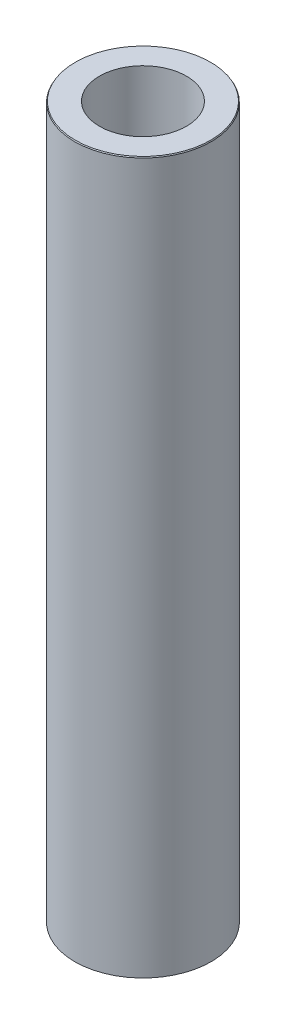
ISO-10303-21;
HEADER;
FILE_DESCRIPTION(('STEP AP214'),'2;1');
FILE_NAME('part.step','',(''),(''),'','','');
FILE_SCHEMA(('AUTOMOTIVE_DESIGN { 1 0 10303 214 1 1 1 1 }'));
ENDSEC;
DATA;
#1=APPLICATION_CONTEXT('core data for automotive mechanical design processes');
#2=APPLICATION_PROTOCOL_DEFINITION('international standard','automotive_design',2000,#1);
#3=PRODUCT_CONTEXT('',#1,'mechanical');
#4=PRODUCT('Part','Part','',(#3));
#5=PRODUCT_RELATED_PRODUCT_CATEGORY('part','',(#4));
#6=PRODUCT_DEFINITION_FORMATION('','',#4);
#7=PRODUCT_DEFINITION_CONTEXT('part definition',#1,'design');
#8=PRODUCT_DEFINITION('design','',#6,#7);
#9=PRODUCT_DEFINITION_SHAPE('','',#8);
#10=(LENGTH_UNIT() NAMED_UNIT(*) SI_UNIT(.MILLI.,.METRE.));
#11=(NAMED_UNIT(*) PLANE_ANGLE_UNIT() SI_UNIT($,.RADIAN.));
#12=(NAMED_UNIT(*) SI_UNIT($,.STERADIAN.) SOLID_ANGLE_UNIT());
#13=UNCERTAINTY_MEASURE_WITH_UNIT(LENGTH_MEASURE(1.E-05),#10,'distance_accuracy_value','');
#14=(GEOMETRIC_REPRESENTATION_CONTEXT(3) GLOBAL_UNCERTAINTY_ASSIGNED_CONTEXT((#13)) GLOBAL_UNIT_ASSIGNED_CONTEXT((#10,
#11,#12)) REPRESENTATION_CONTEXT('',''));
#15=CARTESIAN_POINT('',(0.,0.,0.));
#16=DIRECTION('',(0.,0.,1.));
#17=DIRECTION('',(1.,0.,0.));
#18=AXIS2_PLACEMENT_3D('',#15,#16,#17);
#19=CARTESIAN_POINT('',(0.,600.,0.));
#20=DIRECTION('',(0.,-1.,0.));
#21=DIRECTION('',(0.,0.,-1.));
#22=AXIS2_PLACEMENT_3D('',#19,#20,#21);
#23=CYLINDRICAL_SURFACE('',#22,57.5);
#24=CARTESIAN_POINT('',(0.,599.141360255556,0.));
#25=DIRECTION('',(0.,1.,0.));
#26=DIRECTION('',(0.,0.,1.));
#27=AXIS2_PLACEMENT_3D('',#24,#25,#26);
#28=CIRCLE('',#27,57.5);
#29=CARTESIAN_POINT('',(0.,599.141360255556,57.5));
#30=VERTEX_POINT('',#29);
#31=EDGE_CURVE('E50',#30,#30,#28,.F.);
#32=ORIENTED_EDGE('',*,*,#31,.T.);
#33=EDGE_LOOP('',(#32));
#34=FACE_BOUND('',#33,.T.);
#35=CARTESIAN_POINT('',(0.,0.495735887591664,0.));
#36=DIRECTION('',(0.,1.,0.));
#37=DIRECTION('',(0.,0.,1.));
#38=AXIS2_PLACEMENT_3D('',#35,#36,#37);
#39=CIRCLE('',#38,57.5);
#40=CARTESIAN_POINT('',(0.,0.495735887591664,57.5));
#41=VERTEX_POINT('',#40);
#42=EDGE_CURVE('E51',#41,#41,#39,.T.);
#43=ORIENTED_EDGE('',*,*,#42,.T.);
#44=EDGE_LOOP('',(#43));
#45=FACE_BOUND('',#44,.T.);
#46=ADVANCED_FACE('F39',(#34,#45),#23,.T.);
#47=CARTESIAN_POINT('',(0.,600.,0.));
#48=DIRECTION('',(0.,1.,0.));
#49=DIRECTION('',(0.,0.,1.));
#50=AXIS2_PLACEMENT_3D('',#47,#48,#49);
#51=PLANE('',#50);
#52=CARTESIAN_POINT('',(0.,600.,0.));
#53=DIRECTION('',(0.,1.,0.));
#54=DIRECTION('',(0.,0.,1.));
#55=AXIS2_PLACEMENT_3D('',#52,#53,#54);
#56=CIRCLE('',#55,57.0042641124083);
#57=CARTESIAN_POINT('',(0.,600.,57.0042641124083));
#58=VERTEX_POINT('',#57);
#59=EDGE_CURVE('E54',#58,#58,#56,.T.);
#60=ORIENTED_EDGE('',*,*,#59,.T.);
#61=EDGE_LOOP('',(#60));
#62=FACE_BOUND('',#61,.T.);
#63=CARTESIAN_POINT('',(0.,600.,0.));
#64=DIRECTION('',(0.,1.,0.));
#65=DIRECTION('',(0.,0.,1.));
#66=AXIS2_PLACEMENT_3D('',#63,#64,#65);
#67=CIRCLE('',#66,36.6710345801944);
#68=CARTESIAN_POINT('',(0.,600.,36.6710345801944));
#69=VERTEX_POINT('',#68);
#70=EDGE_CURVE('E58',#69,#69,#67,.T.);
#71=ORIENTED_EDGE('',*,*,#70,.F.);
#72=EDGE_LOOP('',(#71));
#73=FACE_BOUND('',#72,.T.);
#74=ADVANCED_FACE('F69',(#62,#73),#51,.T.);
#75=CARTESIAN_POINT('',(0.,0.,0.));
#76=DIRECTION('',(0.,1.,0.));
#77=DIRECTION('',(0.,0.,1.));
#78=AXIS2_PLACEMENT_3D('',#75,#76,#77);
#79=PLANE('',#78);
#80=CARTESIAN_POINT('',(0.,0.,0.));
#81=DIRECTION('',(0.,1.,0.));
#82=DIRECTION('',(0.,0.,1.));
#83=AXIS2_PLACEMENT_3D('',#80,#81,#82);
#84=CIRCLE('',#83,56.6413602555559);
#85=CARTESIAN_POINT('',(0.,0.,56.6413602555559));
#86=VERTEX_POINT('',#85);
#87=EDGE_CURVE('E10',#86,#86,#84,.F.);
#88=ORIENTED_EDGE('',*,*,#87,.T.);
#89=EDGE_LOOP('',(#88));
#90=FACE_BOUND('',#89,.T.);
#91=CARTESIAN_POINT('',(0.,0.,0.));
#92=DIRECTION('',(0.,1.,0.));
#93=DIRECTION('',(0.,0.,1.));
#94=AXIS2_PLACEMENT_3D('',#91,#92,#93);
#95=CIRCLE('',#94,36.6710345801944);
#96=CARTESIAN_POINT('',(0.,0.,36.6710345801944));
#97=VERTEX_POINT('',#96);
#98=EDGE_CURVE('E63',#97,#97,#95,.T.);
#99=ORIENTED_EDGE('',*,*,#98,.T.);
#100=EDGE_LOOP('',(#99));
#101=FACE_BOUND('',#100,.T.);
#102=ADVANCED_FACE('F75',(#90,#101),#79,.F.);
#103=CARTESIAN_POINT('',(0.,600.,0.));
#104=DIRECTION('',(0.,-1.,0.));
#105=DIRECTION('',(0.,0.,-1.));
#106=AXIS2_PLACEMENT_3D('',#103,#104,#105);
#107=CYLINDRICAL_SURFACE('',#106,36.6710345801944);
#108=ORIENTED_EDGE('',*,*,#70,.T.);
#109=EDGE_LOOP('',(#108));
#110=FACE_BOUND('',#109,.T.);
#111=ORIENTED_EDGE('',*,*,#98,.F.);
#112=EDGE_LOOP('',(#111));
#113=FACE_BOUND('',#112,.T.);
#114=ADVANCED_FACE('F70',(#110,#113),#107,.F.);
#115=CARTESIAN_POINT('',(0.,600.,0.));
#116=DIRECTION('',(0.,-1.,0.));
#117=DIRECTION('',(0.,0.,-1.));
#118=AXIS2_PLACEMENT_3D('',#115,#116,#117);
#119=CONICAL_SURFACE('',#118,57.0042641124083,0.523598775598249);
#120=ORIENTED_EDGE('',*,*,#31,.F.);
#121=EDGE_LOOP('',(#120));
#122=FACE_BOUND('',#121,.T.);
#123=ORIENTED_EDGE('',*,*,#59,.F.);
#124=EDGE_LOOP('',(#123));
#125=FACE_BOUND('',#124,.T.);
#126=ADVANCED_FACE('F81',(#122,#125),#119,.T.);
#127=CARTESIAN_POINT('',(0.,0.495735887591664,0.));
#128=DIRECTION('',(0.,1.,0.));
#129=DIRECTION('',(0.,0.,1.));
#130=AXIS2_PLACEMENT_3D('',#127,#128,#129);
#131=CONICAL_SURFACE('',#130,57.5,1.04719755119663);
#132=ORIENTED_EDGE('',*,*,#87,.F.);
#133=EDGE_LOOP('',(#132));
#134=FACE_BOUND('',#133,.T.);
#135=ORIENTED_EDGE('',*,*,#42,.F.);
#136=EDGE_LOOP('',(#135));
#137=FACE_BOUND('',#136,.T.);
#138=ADVANCED_FACE('F45',(#134,#137),#131,.T.);
#139=CLOSED_SHELL('',(#46,#74,#102,#114,#126,#138));
#140=MANIFOLD_SOLID_BREP('B2',#139);
#141=ADVANCED_BREP_SHAPE_REPRESENTATION('',(#18,#140),#14);
#142=SHAPE_DEFINITION_REPRESENTATION(#9,#141);
ENDSEC;
END-ISO-10303-21;
